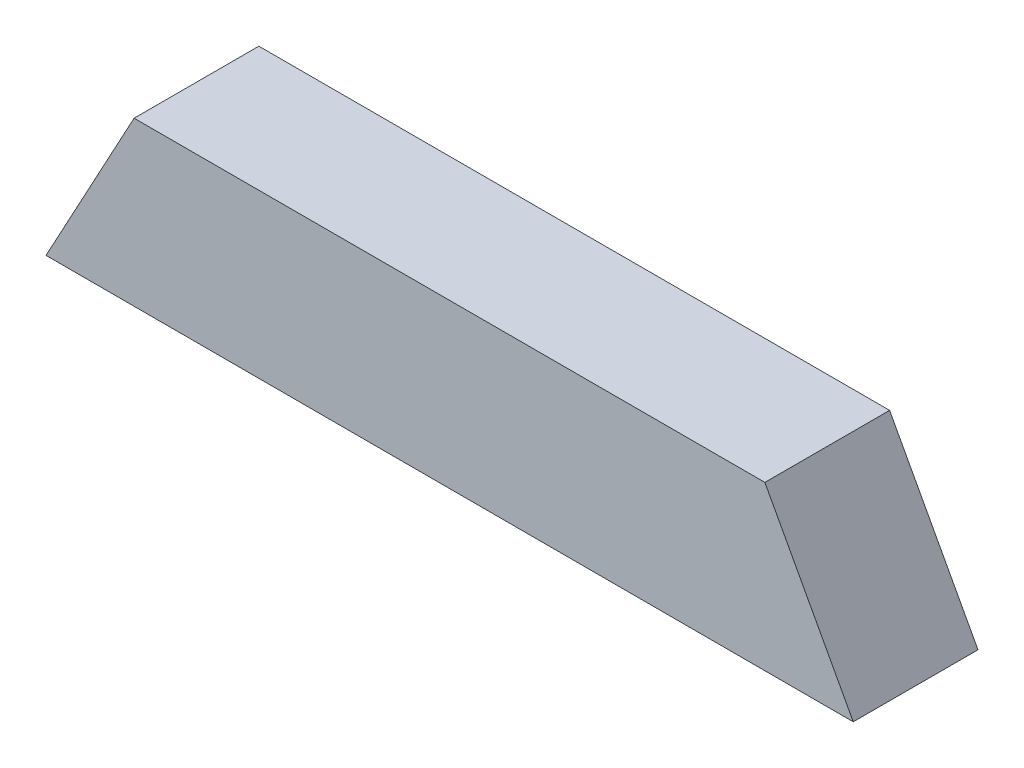
ISO-10303-21;
HEADER;
FILE_DESCRIPTION(('STEP AP214'),'2;1');
FILE_NAME('part.step','',(''),(''),'','','');
FILE_SCHEMA(('AUTOMOTIVE_DESIGN { 1 0 10303 214 1 1 1 1 }'));
ENDSEC;
DATA;
#1=APPLICATION_CONTEXT('core data for automotive mechanical design processes');
#2=APPLICATION_PROTOCOL_DEFINITION('international standard','automotive_design',2000,#1);
#3=PRODUCT_CONTEXT('',#1,'mechanical');
#4=PRODUCT('Part','Part','',(#3));
#5=PRODUCT_RELATED_PRODUCT_CATEGORY('part','',(#4));
#6=PRODUCT_DEFINITION_FORMATION('','',#4);
#7=PRODUCT_DEFINITION_CONTEXT('part definition',#1,'design');
#8=PRODUCT_DEFINITION('design','',#6,#7);
#9=PRODUCT_DEFINITION_SHAPE('','',#8);
#10=(LENGTH_UNIT() NAMED_UNIT(*) SI_UNIT(.MILLI.,.METRE.));
#11=(NAMED_UNIT(*) PLANE_ANGLE_UNIT() SI_UNIT($,.RADIAN.));
#12=(NAMED_UNIT(*) SI_UNIT($,.STERADIAN.) SOLID_ANGLE_UNIT());
#13=UNCERTAINTY_MEASURE_WITH_UNIT(LENGTH_MEASURE(1.E-05),#10,'distance_accuracy_value','');
#14=(GEOMETRIC_REPRESENTATION_CONTEXT(3) GLOBAL_UNCERTAINTY_ASSIGNED_CONTEXT((#13)) GLOBAL_UNIT_ASSIGNED_CONTEXT((#10,
#11,#12)) REPRESENTATION_CONTEXT('',''));
#15=CARTESIAN_POINT('',(0.,0.,0.));
#16=DIRECTION('',(0.,0.,1.));
#17=DIRECTION('',(1.,0.,0.));
#18=AXIS2_PLACEMENT_3D('',#15,#16,#17);
#19=CARTESIAN_POINT('',(0.,36.25,38.));
#20=DIRECTION('',(0.,-1.,0.));
#21=DIRECTION('',(0.,0.,-1.));
#22=AXIS2_PLACEMENT_3D('',#19,#20,#21);
#23=PLANE('',#22);
#24=DIRECTION('',(-1.,0.,0.));
#25=VECTOR('',#24,1.);
#26=CARTESIAN_POINT('',(0.,36.25,-6.));
#27=LINE('',#26,#25);
#28=CARTESIAN_POINT('',(111.222575033311,36.25,-6.));
#29=VERTEX_POINT('',#28);
#30=CARTESIAN_POINT('',(-111.260793608354,36.25,-6.));
#31=VERTEX_POINT('',#30);
#32=EDGE_CURVE('E143',#29,#31,#27,.T.);
#33=ORIENTED_EDGE('',*,*,#32,.T.);
#34=DIRECTION('',(0.,0.,-1.));
#35=VECTOR('',#34,1.);
#36=CARTESIAN_POINT('',(-111.260793608354,36.25,38.));
#37=LINE('',#36,#35);
#38=CARTESIAN_POINT('',(-111.260793608354,36.25,38.));
#39=VERTEX_POINT('',#38);
#40=EDGE_CURVE('E11',#39,#31,#37,.T.);
#41=ORIENTED_EDGE('',*,*,#40,.F.);
#42=DIRECTION('',(-1.,0.,0.));
#43=VECTOR('',#42,1.);
#44=CARTESIAN_POINT('',(0.,36.25,38.));
#45=LINE('',#44,#43);
#46=CARTESIAN_POINT('',(111.222575033311,36.25,38.));
#47=VERTEX_POINT('',#46);
#48=EDGE_CURVE('E154',#47,#39,#45,.T.);
#49=ORIENTED_EDGE('',*,*,#48,.F.);
#50=DIRECTION('',(0.,0.,-1.));
#51=VECTOR('',#50,1.);
#52=CARTESIAN_POINT('',(111.222575033311,36.25,38.));
#53=LINE('',#52,#51);
#54=EDGE_CURVE('E167',#47,#29,#53,.T.);
#55=ORIENTED_EDGE('',*,*,#54,.T.);
#56=EDGE_LOOP('',(#33,#41,#49,#55));
#57=FACE_BOUND('',#56,.T.);
#58=ADVANCED_FACE('F41',(#57),#23,.F.);
#59=CARTESIAN_POINT('',(-101.247922822515,54.7623851899454,38.));
#60=DIRECTION('',(0.87958373123692,-0.475744111622349,0.));
#61=DIRECTION('',(0.475744111622349,0.87958373123692,0.));
#62=AXIS2_PLACEMENT_3D('',#59,#60,#61);
#63=PLANE('',#62);
#64=DIRECTION('',(-0.475744111622349,-0.87958373123692,0.));
#65=VECTOR('',#64,1.);
#66=CARTESIAN_POINT('',(-101.247922822515,54.7623851899454,-6.));
#67=LINE('',#66,#65);
#68=CARTESIAN_POINT('',(-142.331864381627,-21.1960254927466,-6.));
#69=VERTEX_POINT('',#68);
#70=EDGE_CURVE('E147',#31,#69,#67,.T.);
#71=ORIENTED_EDGE('',*,*,#70,.T.);
#72=DIRECTION('',(0.,0.,-1.));
#73=VECTOR('',#72,1.);
#74=CARTESIAN_POINT('',(-142.331864381627,-21.1960254927466,38.));
#75=LINE('',#74,#73);
#76=CARTESIAN_POINT('',(-142.331864381627,-21.1960254927466,38.));
#77=VERTEX_POINT('',#76);
#78=EDGE_CURVE('E49',#77,#69,#75,.T.);
#79=ORIENTED_EDGE('',*,*,#78,.F.);
#80=DIRECTION('',(-0.475744111622349,-0.87958373123692,0.));
#81=VECTOR('',#80,1.);
#82=CARTESIAN_POINT('',(-101.247922822515,54.7623851899454,38.));
#83=LINE('',#82,#81);
#84=EDGE_CURVE('E158',#39,#77,#83,.T.);
#85=ORIENTED_EDGE('',*,*,#84,.F.);
#86=ORIENTED_EDGE('',*,*,#40,.T.);
#87=EDGE_LOOP('',(#71,#79,#85,#86));
#88=FACE_BOUND('',#87,.T.);
#89=ADVANCED_FACE('F198',(#88),#63,.F.);
#90=CARTESIAN_POINT('',(-95.9704204350936,51.9079205202113,38.));
#91=DIRECTION('',(0.87958373123692,-0.475744111622349,0.));
#92=DIRECTION('',(0.475744111622349,0.87958373123692,0.));
#93=AXIS2_PLACEMENT_3D('',#90,#91,#92);
#94=PLANE('',#93);
#95=DIRECTION('',(0.475744111622349,0.87958373123692,0.));
#96=VECTOR('',#95,1.);
#97=CARTESIAN_POINT('',(-95.9704204350936,51.9079205202113,32.));
#98=LINE('',#97,#96);
#99=CARTESIAN_POINT('',(-135.511854398941,-21.198611278522,32.));
#100=VERTEX_POINT('',#99);
#101=CARTESIAN_POINT('',(-107.684629999868,30.25,32.));
#102=VERTEX_POINT('',#101);
#103=EDGE_CURVE('E131',#100,#102,#98,.T.);
#104=ORIENTED_EDGE('',*,*,#103,.F.);
#105=DIRECTION('',(0.,0.,-1.));
#106=VECTOR('',#105,1.);
#107=CARTESIAN_POINT('',(-135.511854398941,-21.198611278522,38.));
#108=LINE('',#107,#106);
#109=CARTESIAN_POINT('',(-135.511854398941,-21.198611278522,0.));
#110=VERTEX_POINT('',#109);
#111=EDGE_CURVE('E125',#100,#110,#108,.T.);
#112=ORIENTED_EDGE('',*,*,#111,.T.);
#113=DIRECTION('',(-0.475744111622349,-0.87958373123692,0.));
#114=VECTOR('',#113,1.);
#115=CARTESIAN_POINT('',(-95.9704204350936,51.9079205202113,0.));
#116=LINE('',#115,#114);
#117=CARTESIAN_POINT('',(-107.684629999868,30.25,0.));
#118=VERTEX_POINT('',#117);
#119=EDGE_CURVE('E151',#118,#110,#116,.T.);
#120=ORIENTED_EDGE('',*,*,#119,.F.);
#121=DIRECTION('',(0.,0.,-1.));
#122=VECTOR('',#121,1.);
#123=CARTESIAN_POINT('',(-107.684629999868,30.25,38.));
#124=LINE('',#123,#122);
#125=EDGE_CURVE('E183',#102,#118,#124,.T.);
#126=ORIENTED_EDGE('',*,*,#125,.F.);
#127=EDGE_LOOP('',(#104,#112,#120,#126));
#128=FACE_BOUND('',#127,.T.);
#129=ADVANCED_FACE('F222',(#128),#94,.T.);
#130=CARTESIAN_POINT('',(0.,30.25,38.));
#131=DIRECTION('',(0.,-1.,0.));
#132=DIRECTION('',(0.,0.,-1.));
#133=AXIS2_PLACEMENT_3D('',#130,#131,#132);
#134=PLANE('',#133);
#135=DIRECTION('',(1.,0.,0.));
#136=VECTOR('',#135,1.);
#137=CARTESIAN_POINT('',(0.,30.25,32.));
#138=LINE('',#137,#136);
#139=CARTESIAN_POINT('',(107.648903001332,30.25,32.));
#140=VERTEX_POINT('',#139);
#141=EDGE_CURVE('E56',#102,#140,#138,.T.);
#142=ORIENTED_EDGE('',*,*,#141,.F.);
#143=ORIENTED_EDGE('',*,*,#125,.T.);
#144=DIRECTION('',(-1.,0.,0.));
#145=VECTOR('',#144,1.);
#146=CARTESIAN_POINT('',(0.,30.25,0.));
#147=LINE('',#146,#145);
#148=CARTESIAN_POINT('',(107.648903001332,30.25,0.));
#149=VERTEX_POINT('',#148);
#150=EDGE_CURVE('E171',#149,#118,#147,.T.);
#151=ORIENTED_EDGE('',*,*,#150,.F.);
#152=DIRECTION('',(0.,0.,-1.));
#153=VECTOR('',#152,1.);
#154=CARTESIAN_POINT('',(107.648903001332,30.25,38.));
#155=LINE('',#154,#153);
#156=EDGE_CURVE('E112',#140,#149,#155,.T.);
#157=ORIENTED_EDGE('',*,*,#156,.F.);
#158=EDGE_LOOP('',(#142,#143,#151,#157));
#159=FACE_BOUND('',#158,.T.);
#160=ADVANCED_FACE('F226',(#159),#134,.T.);
#161=CARTESIAN_POINT('',(95.8976753406274,51.94457414284,38.));
#162=DIRECTION('',(-0.879291966536773,-0.476283148540754,0.));
#163=DIRECTION('',(0.476283148540754,-0.879291966536773,0.));
#164=AXIS2_PLACEMENT_3D('',#161,#162,#163);
#165=PLANE('',#164);
#166=DIRECTION('',(0.476283148540754,-0.879291966536773,0.));
#167=VECTOR('',#166,1.);
#168=CARTESIAN_POINT('',(95.8976753406274,51.94457414284,32.));
#169=LINE('',#168,#167);
#170=CARTESIAN_POINT('',(135.572573724522,-21.3013921043508,32.));
#171=VERTEX_POINT('',#170);
#172=EDGE_CURVE('E64',#140,#171,#169,.T.);
#173=ORIENTED_EDGE('',*,*,#172,.F.);
#174=ORIENTED_EDGE('',*,*,#156,.T.);
#175=DIRECTION('',(-0.476283148540754,0.879291966536773,0.));
#176=VECTOR('',#175,1.);
#177=CARTESIAN_POINT('',(95.8976753406274,51.94457414284,0.));
#178=LINE('',#177,#176);
#179=CARTESIAN_POINT('',(135.572573724523,-21.3013921043508,0.));
#180=VERTEX_POINT('',#179);
#181=EDGE_CURVE('E106',#180,#149,#178,.T.);
#182=ORIENTED_EDGE('',*,*,#181,.F.);
#183=DIRECTION('',(0.,0.,-1.));
#184=VECTOR('',#183,1.);
#185=CARTESIAN_POINT('',(135.572573724523,-21.3013921043508,38.));
#186=LINE('',#185,#184);
#187=EDGE_CURVE('E103',#171,#180,#186,.T.);
#188=ORIENTED_EDGE('',*,*,#187,.F.);
#189=EDGE_LOOP('',(#173,#174,#182,#188));
#190=FACE_BOUND('',#189,.T.);
#191=ADVANCED_FACE('F104',(#190),#165,.T.);
#192=CARTESIAN_POINT('',(-0.0080568671567502,-21.2499871259274,38.));
#193=DIRECTION('',(0.000379146892179667,0.999999928123814,0.));
#194=DIRECTION('',(-0.999999928123814,0.000379146892179667,0.));
#195=AXIS2_PLACEMENT_3D('',#192,#193,#194);
#196=PLANE('',#195);
#197=ORIENTED_EDGE('',*,*,#111,.F.);
#198=DIRECTION('',(0.999999928123814,-0.000379146892179667,0.));
#199=VECTOR('',#198,1.);
#200=CARTESIAN_POINT('',(-0.0080568671567502,-21.2499871259274,32.));
#201=LINE('',#200,#199);
#202=EDGE_CURVE('E119',#100,#171,#201,.T.);
#203=ORIENTED_EDGE('',*,*,#202,.T.);
#204=ORIENTED_EDGE('',*,*,#187,.T.);
#205=DIRECTION('',(0.999999928123814,-0.000379146892179667,0.));
#206=VECTOR('',#205,1.);
#207=CARTESIAN_POINT('',(-0.0080568671567502,-21.2499871259274,0.));
#208=LINE('',#207,#206);
#209=EDGE_CURVE('E134',#110,#180,#208,.T.);
#210=ORIENTED_EDGE('',*,*,#209,.F.);
#211=EDGE_LOOP('',(#197,#203,#204,#210));
#212=FACE_BOUND('',#211,.T.);
#213=DIRECTION('',(0.999999928123814,-0.000379146892179667,0.));
#214=VECTOR('',#213,1.);
#215=CARTESIAN_POINT('',(-0.0080568671567502,-21.2499871259274,-6.));
#216=LINE('',#215,#214);
#217=CARTESIAN_POINT('',(142.397647430405,-21.3039798100213,-6.));
#218=VERTEX_POINT('',#217);
#219=EDGE_CURVE('E135',#69,#218,#216,.T.);
#220=ORIENTED_EDGE('',*,*,#219,.T.);
#221=DIRECTION('',(0.,0.,-1.));
#222=VECTOR('',#221,1.);
#223=CARTESIAN_POINT('',(142.397647430405,-21.3039798100213,38.));
#224=LINE('',#223,#222);
#225=CARTESIAN_POINT('',(142.397647430405,-21.3039798100213,38.));
#226=VERTEX_POINT('',#225);
#227=EDGE_CURVE('E113',#226,#218,#224,.T.);
#228=ORIENTED_EDGE('',*,*,#227,.F.);
#229=DIRECTION('',(0.999999928123814,-0.000379146892179667,0.));
#230=VECTOR('',#229,1.);
#231=CARTESIAN_POINT('',(-0.0080568671567502,-21.2499871259274,38.));
#232=LINE('',#231,#230);
#233=EDGE_CURVE('E161',#77,#226,#232,.T.);
#234=ORIENTED_EDGE('',*,*,#233,.F.);
#235=ORIENTED_EDGE('',*,*,#78,.T.);
#236=EDGE_LOOP('',(#220,#228,#234,#235));
#237=FACE_BOUND('',#236,.T.);
#238=ADVANCED_FACE('F123',(#212,#237),#196,.F.);
#239=CARTESIAN_POINT('',(101.173427139848,54.8022730340845,38.));
#240=DIRECTION('',(-0.879291966536774,-0.476283148540753,0.));
#241=DIRECTION('',(0.476283148540753,-0.879291966536774,0.));
#242=AXIS2_PLACEMENT_3D('',#239,#240,#241);
#243=PLANE('',#242);
#244=DIRECTION('',(-0.476283148540753,0.879291966536774,0.));
#245=VECTOR('',#244,1.);
#246=CARTESIAN_POINT('',(101.173427139848,54.8022730340845,-6.));
#247=LINE('',#246,#245);
#248=EDGE_CURVE('E139',#218,#29,#247,.T.);
#249=ORIENTED_EDGE('',*,*,#248,.T.);
#250=ORIENTED_EDGE('',*,*,#54,.F.);
#251=DIRECTION('',(-0.476283148540753,0.879291966536774,0.));
#252=VECTOR('',#251,1.);
#253=CARTESIAN_POINT('',(101.173427139848,54.8022730340845,38.));
#254=LINE('',#253,#252);
#255=EDGE_CURVE('E164',#226,#47,#254,.T.);
#256=ORIENTED_EDGE('',*,*,#255,.F.);
#257=ORIENTED_EDGE('',*,*,#227,.T.);
#258=EDGE_LOOP('',(#249,#250,#256,#257));
#259=FACE_BOUND('',#258,.T.);
#260=ADVANCED_FACE('F204',(#259),#243,.F.);
#261=CARTESIAN_POINT('',(0.,0.,38.));
#262=DIRECTION('',(0.,0.,1.));
#263=DIRECTION('',(1.,0.,0.));
#264=AXIS2_PLACEMENT_3D('',#261,#262,#263);
#265=PLANE('',#264);
#266=ORIENTED_EDGE('',*,*,#233,.T.);
#267=ORIENTED_EDGE('',*,*,#255,.T.);
#268=ORIENTED_EDGE('',*,*,#48,.T.);
#269=ORIENTED_EDGE('',*,*,#84,.T.);
#270=EDGE_LOOP('',(#266,#267,#268,#269));
#271=FACE_BOUND('',#270,.T.);
#272=ADVANCED_FACE('F207',(#271),#265,.T.);
#273=CARTESIAN_POINT('',(0.,0.,-6.));
#274=DIRECTION('',(0.,0.,1.));
#275=DIRECTION('',(1.,0.,0.));
#276=AXIS2_PLACEMENT_3D('',#273,#274,#275);
#277=PLANE('',#276);
#278=ORIENTED_EDGE('',*,*,#219,.F.);
#279=ORIENTED_EDGE('',*,*,#70,.F.);
#280=ORIENTED_EDGE('',*,*,#32,.F.);
#281=ORIENTED_EDGE('',*,*,#248,.F.);
#282=EDGE_LOOP('',(#278,#279,#280,#281));
#283=FACE_BOUND('',#282,.T.);
#284=ADVANCED_FACE('F196',(#283),#277,.F.);
#285=CARTESIAN_POINT('',(0.,0.,0.));
#286=DIRECTION('',(0.,0.,1.));
#287=DIRECTION('',(1.,0.,0.));
#288=AXIS2_PLACEMENT_3D('',#285,#286,#287);
#289=PLANE('',#288);
#290=ORIENTED_EDGE('',*,*,#209,.T.);
#291=ORIENTED_EDGE('',*,*,#181,.T.);
#292=ORIENTED_EDGE('',*,*,#150,.T.);
#293=ORIENTED_EDGE('',*,*,#119,.T.);
#294=EDGE_LOOP('',(#290,#291,#292,#293));
#295=FACE_BOUND('',#294,.T.);
#296=ADVANCED_FACE('F214',(#295),#289,.T.);
#297=CARTESIAN_POINT('',(0.,0.,32.));
#298=DIRECTION('',(0.,0.,-1.));
#299=DIRECTION('',(1.,0.,0.));
#300=AXIS2_PLACEMENT_3D('',#297,#298,#299);
#301=PLANE('',#300);
#302=ORIENTED_EDGE('',*,*,#202,.F.);
#303=ORIENTED_EDGE('',*,*,#103,.T.);
#304=ORIENTED_EDGE('',*,*,#141,.T.);
#305=ORIENTED_EDGE('',*,*,#172,.T.);
#306=EDGE_LOOP('',(#302,#303,#304,#305));
#307=FACE_BOUND('',#306,.T.);
#308=ADVANCED_FACE('F117',(#307),#301,.T.);
#309=CLOSED_SHELL('',(#58,#89,#129,#160,#191,#238,#260,#272,#284,#296,#308));
#310=MANIFOLD_SOLID_BREP('B2',#309);
#311=ADVANCED_BREP_SHAPE_REPRESENTATION('',(#18,#310),#14);
#312=SHAPE_DEFINITION_REPRESENTATION(#9,#311);
ENDSEC;
END-ISO-10303-21;
